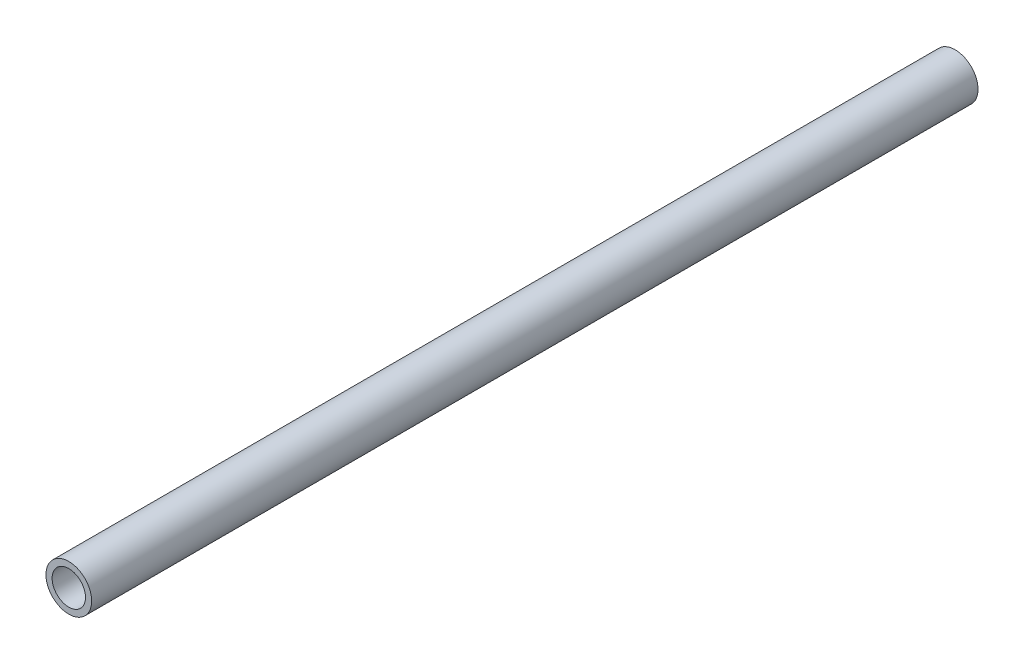
ISO-10303-21;
HEADER;
FILE_DESCRIPTION(('STEP AP214'),'2;1');
FILE_NAME('part.step','',(''),(''),'','','');
FILE_SCHEMA(('AUTOMOTIVE_DESIGN { 1 0 10303 214 1 1 1 1 }'));
ENDSEC;
DATA;
#1=APPLICATION_CONTEXT('core data for automotive mechanical design processes');
#2=APPLICATION_PROTOCOL_DEFINITION('international standard','automotive_design',2000,#1);
#3=PRODUCT_CONTEXT('',#1,'mechanical');
#4=PRODUCT('Part','Part','',(#3));
#5=PRODUCT_RELATED_PRODUCT_CATEGORY('part','',(#4));
#6=PRODUCT_DEFINITION_FORMATION('','',#4);
#7=PRODUCT_DEFINITION_CONTEXT('part definition',#1,'design');
#8=PRODUCT_DEFINITION('design','',#6,#7);
#9=PRODUCT_DEFINITION_SHAPE('','',#8);
#10=(LENGTH_UNIT() NAMED_UNIT(*) SI_UNIT(.MILLI.,.METRE.));
#11=(NAMED_UNIT(*) PLANE_ANGLE_UNIT() SI_UNIT($,.RADIAN.));
#12=(NAMED_UNIT(*) SI_UNIT($,.STERADIAN.) SOLID_ANGLE_UNIT());
#13=UNCERTAINTY_MEASURE_WITH_UNIT(LENGTH_MEASURE(1.E-05),#10,'distance_accuracy_value','');
#14=(GEOMETRIC_REPRESENTATION_CONTEXT(3) GLOBAL_UNCERTAINTY_ASSIGNED_CONTEXT((#13)) GLOBAL_UNIT_ASSIGNED_CONTEXT((#10,
#11,#12)) REPRESENTATION_CONTEXT('',''));
#15=CARTESIAN_POINT('',(0.,0.,0.));
#16=DIRECTION('',(0.,0.,1.));
#17=DIRECTION('',(1.,0.,0.));
#18=AXIS2_PLACEMENT_3D('',#15,#16,#17);
#19=CARTESIAN_POINT('',(0.,0.,207.5));
#20=DIRECTION('',(0.,0.,1.));
#21=DIRECTION('',(1.,0.,0.));
#22=AXIS2_PLACEMENT_3D('',#19,#20,#21);
#23=PLANE('',#22);
#24=CARTESIAN_POINT('',(0.,0.,207.5));
#25=DIRECTION('',(0.,0.,1.));
#26=DIRECTION('',(1.,0.,0.));
#27=AXIS2_PLACEMENT_3D('',#24,#25,#26);
#28=CIRCLE('',#27,10.7);
#29=CARTESIAN_POINT('',(10.7,0.,207.5));
#30=VERTEX_POINT('',#29);
#31=EDGE_CURVE('E10',#30,#30,#28,.T.);
#32=ORIENTED_EDGE('',*,*,#31,.T.);
#33=EDGE_LOOP('',(#32));
#34=FACE_BOUND('',#33,.T.);
#35=CARTESIAN_POINT('',(0.,0.,207.5));
#36=DIRECTION('',(0.,0.,1.));
#37=DIRECTION('',(1.,0.,0.));
#38=AXIS2_PLACEMENT_3D('',#35,#36,#37);
#39=CIRCLE('',#38,7.825);
#40=CARTESIAN_POINT('',(7.825,0.,207.5));
#41=VERTEX_POINT('',#40);
#42=EDGE_CURVE('E43',#41,#41,#39,.T.);
#43=ORIENTED_EDGE('',*,*,#42,.F.);
#44=EDGE_LOOP('',(#43));
#45=FACE_BOUND('',#44,.T.);
#46=ADVANCED_FACE('F32',(#34,#45),#23,.T.);
#47=CARTESIAN_POINT('',(0.,0.,-207.5));
#48=DIRECTION('',(0.,0.,1.));
#49=DIRECTION('',(1.,0.,0.));
#50=AXIS2_PLACEMENT_3D('',#47,#48,#49);
#51=PLANE('',#50);
#52=CARTESIAN_POINT('',(0.,0.,-207.5));
#53=DIRECTION('',(0.,0.,1.));
#54=DIRECTION('',(1.,0.,0.));
#55=AXIS2_PLACEMENT_3D('',#52,#53,#54);
#56=CIRCLE('',#55,10.7);
#57=CARTESIAN_POINT('',(10.7,0.,-207.5));
#58=VERTEX_POINT('',#57);
#59=EDGE_CURVE('E36',#58,#58,#56,.T.);
#60=ORIENTED_EDGE('',*,*,#59,.F.);
#61=EDGE_LOOP('',(#60));
#62=FACE_BOUND('',#61,.T.);
#63=CARTESIAN_POINT('',(0.,0.,-207.5));
#64=DIRECTION('',(0.,0.,1.));
#65=DIRECTION('',(1.,0.,0.));
#66=AXIS2_PLACEMENT_3D('',#63,#64,#65);
#67=CIRCLE('',#66,7.825);
#68=CARTESIAN_POINT('',(7.825,0.,-207.5));
#69=VERTEX_POINT('',#68);
#70=EDGE_CURVE('E45',#69,#69,#67,.T.);
#71=ORIENTED_EDGE('',*,*,#70,.T.);
#72=EDGE_LOOP('',(#71));
#73=FACE_BOUND('',#72,.T.);
#74=ADVANCED_FACE('F55',(#62,#73),#51,.F.);
#75=CARTESIAN_POINT('',(0.,0.,207.5));
#76=DIRECTION('',(0.,0.,-1.));
#77=DIRECTION('',(-1.,0.,0.));
#78=AXIS2_PLACEMENT_3D('',#75,#76,#77);
#79=CYLINDRICAL_SURFACE('',#78,10.7);
#80=ORIENTED_EDGE('',*,*,#31,.F.);
#81=EDGE_LOOP('',(#80));
#82=FACE_BOUND('',#81,.T.);
#83=ORIENTED_EDGE('',*,*,#59,.T.);
#84=EDGE_LOOP('',(#83));
#85=FACE_BOUND('',#84,.T.);
#86=ADVANCED_FACE('F34',(#82,#85),#79,.T.);
#87=CARTESIAN_POINT('',(0.,0.,207.5));
#88=DIRECTION('',(0.,0.,-1.));
#89=DIRECTION('',(-1.,0.,0.));
#90=AXIS2_PLACEMENT_3D('',#87,#88,#89);
#91=CYLINDRICAL_SURFACE('',#90,7.825);
#92=ORIENTED_EDGE('',*,*,#42,.T.);
#93=EDGE_LOOP('',(#92));
#94=FACE_BOUND('',#93,.T.);
#95=ORIENTED_EDGE('',*,*,#70,.F.);
#96=EDGE_LOOP('',(#95));
#97=FACE_BOUND('',#96,.T.);
#98=ADVANCED_FACE('F51',(#94,#97),#91,.F.);
#99=CLOSED_SHELL('',(#46,#74,#86,#98));
#100=MANIFOLD_SOLID_BREP('B2',#99);
#101=ADVANCED_BREP_SHAPE_REPRESENTATION('',(#18,#100),#14);
#102=SHAPE_DEFINITION_REPRESENTATION(#9,#101);
ENDSEC;
END-ISO-10303-21;
